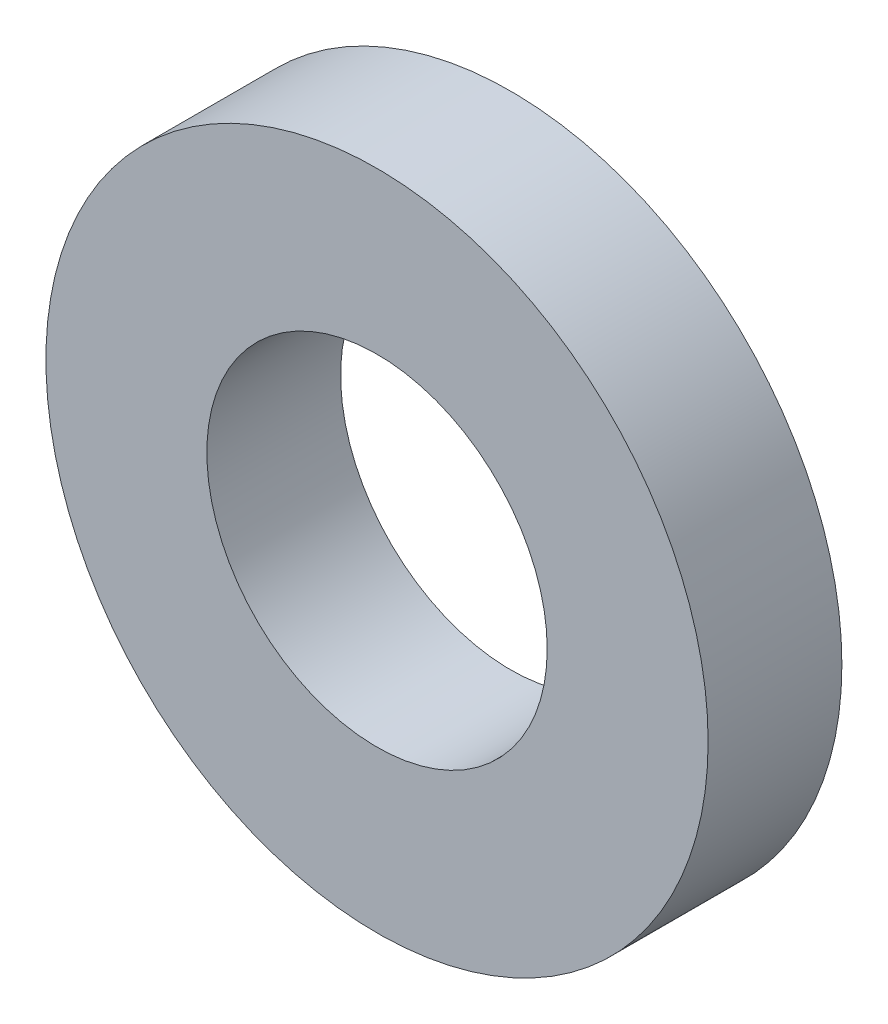
ISO-10303-21;
HEADER;
FILE_DESCRIPTION(('STEP AP214'),'2;1');
FILE_NAME('part.step','',(''),(''),'','','');
FILE_SCHEMA(('AUTOMOTIVE_DESIGN { 1 0 10303 214 1 1 1 1 }'));
ENDSEC;
DATA;
#1=APPLICATION_CONTEXT('core data for automotive mechanical design processes');
#2=APPLICATION_PROTOCOL_DEFINITION('international standard','automotive_design',2000,#1);
#3=PRODUCT_CONTEXT('',#1,'mechanical');
#4=PRODUCT('Part','Part','',(#3));
#5=PRODUCT_RELATED_PRODUCT_CATEGORY('part','',(#4));
#6=PRODUCT_DEFINITION_FORMATION('','',#4);
#7=PRODUCT_DEFINITION_CONTEXT('part definition',#1,'design');
#8=PRODUCT_DEFINITION('design','',#6,#7);
#9=PRODUCT_DEFINITION_SHAPE('','',#8);
#10=(LENGTH_UNIT() NAMED_UNIT(*) SI_UNIT(.MILLI.,.METRE.));
#11=(NAMED_UNIT(*) PLANE_ANGLE_UNIT() SI_UNIT($,.RADIAN.));
#12=(NAMED_UNIT(*) SI_UNIT($,.STERADIAN.) SOLID_ANGLE_UNIT());
#13=UNCERTAINTY_MEASURE_WITH_UNIT(LENGTH_MEASURE(1.E-05),#10,'distance_accuracy_value','');
#14=(GEOMETRIC_REPRESENTATION_CONTEXT(3) GLOBAL_UNCERTAINTY_ASSIGNED_CONTEXT((#13)) GLOBAL_UNIT_ASSIGNED_CONTEXT((#10,
#11,#12)) REPRESENTATION_CONTEXT('',''));
#15=CARTESIAN_POINT('',(0.,0.,0.));
#16=DIRECTION('',(0.,0.,1.));
#17=DIRECTION('',(1.,0.,0.));
#18=AXIS2_PLACEMENT_3D('',#15,#16,#17);
#19=CARTESIAN_POINT('',(0.,0.,-2.5654));
#20=DIRECTION('',(0.,0.,1.));
#21=DIRECTION('',(1.,0.,0.));
#22=AXIS2_PLACEMENT_3D('',#19,#20,#21);
#23=CYLINDRICAL_SURFACE('',#22,6.35);
#24=CARTESIAN_POINT('',(0.,0.,-2.5654));
#25=DIRECTION('',(0.,0.,1.));
#26=DIRECTION('',(1.,0.,0.));
#27=AXIS2_PLACEMENT_3D('',#24,#25,#26);
#28=CIRCLE('',#27,6.35);
#29=CARTESIAN_POINT('',(6.35,0.,-2.5654));
#30=VERTEX_POINT('',#29);
#31=EDGE_CURVE('E10',#30,#30,#28,.T.);
#32=ORIENTED_EDGE('',*,*,#31,.T.);
#33=EDGE_LOOP('',(#32));
#34=FACE_BOUND('',#33,.T.);
#35=CARTESIAN_POINT('',(0.,0.,0.));
#36=DIRECTION('',(0.,0.,1.));
#37=DIRECTION('',(1.,0.,0.));
#38=AXIS2_PLACEMENT_3D('',#35,#36,#37);
#39=CIRCLE('',#38,6.35);
#40=CARTESIAN_POINT('',(6.35,0.,0.));
#41=VERTEX_POINT('',#40);
#42=EDGE_CURVE('E33',#41,#41,#39,.T.);
#43=ORIENTED_EDGE('',*,*,#42,.F.);
#44=EDGE_LOOP('',(#43));
#45=FACE_BOUND('',#44,.T.);
#46=ADVANCED_FACE('F30',(#34,#45),#23,.T.);
#47=CARTESIAN_POINT('',(0.,0.,-2.5654));
#48=DIRECTION('',(0.,0.,1.));
#49=DIRECTION('',(1.,0.,0.));
#50=AXIS2_PLACEMENT_3D('',#47,#48,#49);
#51=PLANE('',#50);
#52=CARTESIAN_POINT('',(0.,0.,-2.5654));
#53=DIRECTION('',(0.,0.,1.));
#54=DIRECTION('',(1.,0.,0.));
#55=AXIS2_PLACEMENT_3D('',#52,#53,#54);
#56=CIRCLE('',#55,3.2639);
#57=CARTESIAN_POINT('',(3.2639,0.,-2.5654));
#58=VERTEX_POINT('',#57);
#59=EDGE_CURVE('E40',#58,#58,#56,.T.);
#60=ORIENTED_EDGE('',*,*,#59,.T.);
#61=EDGE_LOOP('',(#60));
#62=FACE_BOUND('',#61,.T.);
#63=ORIENTED_EDGE('',*,*,#31,.F.);
#64=EDGE_LOOP('',(#63));
#65=FACE_BOUND('',#64,.T.);
#66=ADVANCED_FACE('F48',(#62,#65),#51,.F.);
#67=CARTESIAN_POINT('',(0.,0.,0.));
#68=DIRECTION('',(0.,0.,1.));
#69=DIRECTION('',(1.,0.,0.));
#70=AXIS2_PLACEMENT_3D('',#67,#68,#69);
#71=PLANE('',#70);
#72=CARTESIAN_POINT('',(0.,0.,0.));
#73=DIRECTION('',(0.,0.,1.));
#74=DIRECTION('',(1.,0.,0.));
#75=AXIS2_PLACEMENT_3D('',#72,#73,#74);
#76=CIRCLE('',#75,3.2639);
#77=CARTESIAN_POINT('',(3.2639,0.,0.));
#78=VERTEX_POINT('',#77);
#79=EDGE_CURVE('E42',#78,#78,#76,.T.);
#80=ORIENTED_EDGE('',*,*,#79,.F.);
#81=EDGE_LOOP('',(#80));
#82=FACE_BOUND('',#81,.T.);
#83=ORIENTED_EDGE('',*,*,#42,.T.);
#84=EDGE_LOOP('',(#83));
#85=FACE_BOUND('',#84,.T.);
#86=ADVANCED_FACE('F54',(#82,#85),#71,.T.);
#87=CARTESIAN_POINT('',(0.,0.,-2.5654));
#88=DIRECTION('',(0.,0.,1.));
#89=DIRECTION('',(1.,0.,0.));
#90=AXIS2_PLACEMENT_3D('',#87,#88,#89);
#91=CYLINDRICAL_SURFACE('',#90,3.2639);
#92=ORIENTED_EDGE('',*,*,#59,.F.);
#93=EDGE_LOOP('',(#92));
#94=FACE_BOUND('',#93,.T.);
#95=ORIENTED_EDGE('',*,*,#79,.T.);
#96=EDGE_LOOP('',(#95));
#97=FACE_BOUND('',#96,.T.);
#98=ADVANCED_FACE('F51',(#94,#97),#91,.F.);
#99=CLOSED_SHELL('',(#46,#66,#86,#98));
#100=MANIFOLD_SOLID_BREP('B2',#99);
#101=ADVANCED_BREP_SHAPE_REPRESENTATION('',(#18,#100),#14);
#102=SHAPE_DEFINITION_REPRESENTATION(#9,#101);
ENDSEC;
END-ISO-10303-21;
